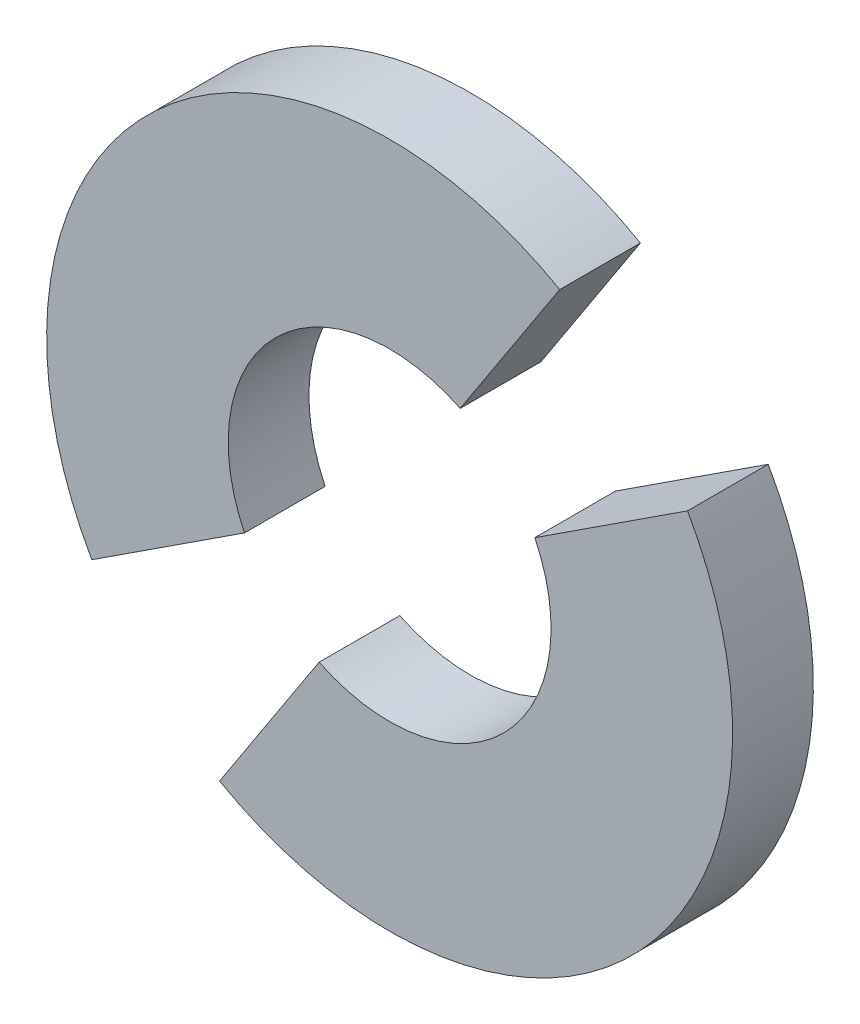
ISO-10303-21;
HEADER;
FILE_DESCRIPTION(('STEP AP214'),'2;1');
FILE_NAME('part.step','',(''),(''),'','','');
FILE_SCHEMA(('AUTOMOTIVE_DESIGN { 1 0 10303 214 1 1 1 1 }'));
ENDSEC;
DATA;
#1=APPLICATION_CONTEXT('core data for automotive mechanical design processes');
#2=APPLICATION_PROTOCOL_DEFINITION('international standard','automotive_design',2000,#1);
#3=PRODUCT_CONTEXT('',#1,'mechanical');
#4=PRODUCT('Part','Part','',(#3));
#5=PRODUCT_RELATED_PRODUCT_CATEGORY('part','',(#4));
#6=PRODUCT_DEFINITION_FORMATION('','',#4);
#7=PRODUCT_DEFINITION_CONTEXT('part definition',#1,'design');
#8=PRODUCT_DEFINITION('design','',#6,#7);
#9=PRODUCT_DEFINITION_SHAPE('','',#8);
#10=(LENGTH_UNIT() NAMED_UNIT(*) SI_UNIT(.MILLI.,.METRE.));
#11=(NAMED_UNIT(*) PLANE_ANGLE_UNIT() SI_UNIT($,.RADIAN.));
#12=(NAMED_UNIT(*) SI_UNIT($,.STERADIAN.) SOLID_ANGLE_UNIT());
#13=UNCERTAINTY_MEASURE_WITH_UNIT(LENGTH_MEASURE(1.E-05),#10,'distance_accuracy_value','');
#14=(GEOMETRIC_REPRESENTATION_CONTEXT(3) GLOBAL_UNCERTAINTY_ASSIGNED_CONTEXT((#13)) GLOBAL_UNIT_ASSIGNED_CONTEXT((#10,
#11,#12)) REPRESENTATION_CONTEXT('',''));
#15=CARTESIAN_POINT('',(0.,0.,0.));
#16=DIRECTION('',(0.,0.,1.));
#17=DIRECTION('',(1.,0.,0.));
#18=AXIS2_PLACEMENT_3D('',#15,#16,#17);
#19=CARTESIAN_POINT('',(-5.00539641632136,-8.95876148749942,6.35));
#20=DIRECTION('',(0.,0.,-1.));
#21=DIRECTION('',(-1.,0.,0.));
#22=AXIS2_PLACEMENT_3D('',#19,#20,#21);
#23=CYLINDRICAL_SURFACE('',#22,26.9875);
#24=CARTESIAN_POINT('',(-5.00539641632136,-8.95876148749942,0.));
#25=DIRECTION('',(0.,0.,1.));
#26=DIRECTION('',(1.,0.,0.));
#27=AXIS2_PLACEMENT_3D('',#24,#25,#26);
#28=CIRCLE('',#27,26.9875);
#29=CARTESIAN_POINT('',(8.37713155542707,14.4769612736055,0.));
#30=VERTEX_POINT('',#29);
#31=CARTESIAN_POINT('',(-28.4411191774267,-22.341289459247,0.));
#32=VERTEX_POINT('',#31);
#33=EDGE_CURVE('E107',#30,#32,#28,.T.);
#34=ORIENTED_EDGE('',*,*,#33,.T.);
#35=DIRECTION('',(0.,0.,-1.));
#36=VECTOR('',#35,1.);
#37=CARTESIAN_POINT('',(-28.4411191774267,-22.341289459247,6.35));
#38=LINE('',#37,#36);
#39=CARTESIAN_POINT('',(-28.4411191774267,-22.341289459247,6.35));
#40=VERTEX_POINT('',#39);
#41=EDGE_CURVE('E12',#40,#32,#38,.T.);
#42=ORIENTED_EDGE('',*,*,#41,.F.);
#43=CARTESIAN_POINT('',(-5.00539641632136,-8.95876148749942,6.35));
#44=DIRECTION('',(0.,0.,1.));
#45=DIRECTION('',(1.,0.,0.));
#46=AXIS2_PLACEMENT_3D('',#43,#44,#45);
#47=CIRCLE('',#46,26.9875);
#48=CARTESIAN_POINT('',(8.37713155542707,14.4769612736055,6.35));
#49=VERTEX_POINT('',#48);
#50=EDGE_CURVE('E95',#49,#40,#47,.T.);
#51=ORIENTED_EDGE('',*,*,#50,.F.);
#52=DIRECTION('',(0.,0.,-1.));
#53=VECTOR('',#52,1.);
#54=CARTESIAN_POINT('',(8.37713155542707,14.4769612736055,6.35));
#55=LINE('',#54,#53);
#56=EDGE_CURVE('E103',#49,#30,#55,.T.);
#57=ORIENTED_EDGE('',*,*,#56,.T.);
#58=EDGE_LOOP('',(#34,#42,#51,#57));
#59=FACE_BOUND('',#58,.T.);
#60=ADVANCED_FACE('F44',(#59),#23,.T.);
#61=CARTESIAN_POINT('',(-28.4411191774267,-22.341289459247,6.35));
#62=DIRECTION('',(-0.546101961014411,0.837718716620451,0.));
#63=DIRECTION('',(-0.837718716620451,-0.546101961014411,0.));
#64=AXIS2_PLACEMENT_3D('',#61,#62,#63);
#65=PLANE('',#64);
#66=DIRECTION('',(0.837718716620451,0.546101961014411,0.));
#67=VECTOR('',#66,1.);
#68=CARTESIAN_POINT('',(-28.4411191774267,-22.341289459247,0.));
#69=LINE('',#68,#67);
#70=CARTESIAN_POINT('',(-16.4279163376508,-14.509981051418,0.));
#71=VERTEX_POINT('',#70);
#72=EDGE_CURVE('E99',#32,#71,#69,.T.);
#73=ORIENTED_EDGE('',*,*,#72,.T.);
#74=DIRECTION('',(0.,0.,-1.));
#75=VECTOR('',#74,1.);
#76=CARTESIAN_POINT('',(-16.4279163376508,-14.509981051418,6.35));
#77=LINE('',#76,#75);
#78=CARTESIAN_POINT('',(-16.4279163376508,-14.509981051418,6.35));
#79=VERTEX_POINT('',#78);
#80=EDGE_CURVE('E52',#79,#71,#77,.T.);
#81=ORIENTED_EDGE('',*,*,#80,.F.);
#82=DIRECTION('',(0.837718716620451,0.546101961014411,0.));
#83=VECTOR('',#82,1.);
#84=CARTESIAN_POINT('',(-28.4411191774267,-22.341289459247,6.35));
#85=LINE('',#84,#83);
#86=EDGE_CURVE('E90',#40,#79,#85,.T.);
#87=ORIENTED_EDGE('',*,*,#86,.F.);
#88=ORIENTED_EDGE('',*,*,#41,.T.);
#89=EDGE_LOOP('',(#73,#81,#87,#88));
#90=FACE_BOUND('',#89,.T.);
#91=ADVANCED_FACE('F98',(#90),#65,.F.);
#92=CARTESIAN_POINT('',(-5.00539641632136,-8.95876148749942,6.35));
#93=DIRECTION('',(0.,0.,-1.));
#94=DIRECTION('',(-1.,0.,0.));
#95=AXIS2_PLACEMENT_3D('',#92,#93,#94);
#96=CYLINDRICAL_SURFACE('',#95,12.7);
#97=CARTESIAN_POINT('',(-5.00539641632136,-8.95876148749942,0.));
#98=DIRECTION('',(0.,0.,-1.));
#99=DIRECTION('',(1.,0.,0.));
#100=AXIS2_PLACEMENT_3D('',#97,#98,#99);
#101=CIRCLE('',#100,12.7);
#102=CARTESIAN_POINT('',(0.545823147597567,2.46375843382983,0.));
#103=VERTEX_POINT('',#102);
#104=EDGE_CURVE('E77',#71,#103,#101,.T.);
#105=ORIENTED_EDGE('',*,*,#104,.T.);
#106=DIRECTION('',(0.,0.,-1.));
#107=VECTOR('',#106,1.);
#108=CARTESIAN_POINT('',(0.545823147597567,2.46375843382983,6.35));
#109=LINE('',#108,#107);
#110=CARTESIAN_POINT('',(0.545823147597567,2.46375843382983,6.35));
#111=VERTEX_POINT('',#110);
#112=EDGE_CURVE('E100',#111,#103,#109,.T.);
#113=ORIENTED_EDGE('',*,*,#112,.F.);
#114=CARTESIAN_POINT('',(-5.00539641632136,-8.95876148749942,6.35));
#115=DIRECTION('',(0.,0.,-1.));
#116=DIRECTION('',(1.,0.,0.));
#117=AXIS2_PLACEMENT_3D('',#114,#115,#116);
#118=CIRCLE('',#117,12.7);
#119=EDGE_CURVE('E93',#79,#111,#118,.T.);
#120=ORIENTED_EDGE('',*,*,#119,.F.);
#121=ORIENTED_EDGE('',*,*,#80,.T.);
#122=EDGE_LOOP('',(#105,#113,#120,#121));
#123=FACE_BOUND('',#122,.T.);
#124=ADVANCED_FACE('F101',(#123),#96,.F.);
#125=CARTESIAN_POINT('',(0.545823147597567,2.46375843382983,6.35));
#126=DIRECTION('',(-0.837718716620432,0.54610196101444,0.));
#127=DIRECTION('',(-0.54610196101444,-0.837718716620432,0.));
#128=AXIS2_PLACEMENT_3D('',#125,#126,#127);
#129=PLANE('',#128);
#130=DIRECTION('',(0.54610196101444,0.837718716620432,0.));
#131=VECTOR('',#130,1.);
#132=CARTESIAN_POINT('',(0.545823147597567,2.46375843382983,0.));
#133=LINE('',#132,#131);
#134=EDGE_CURVE('E83',#103,#30,#133,.T.);
#135=ORIENTED_EDGE('',*,*,#134,.T.);
#136=ORIENTED_EDGE('',*,*,#56,.F.);
#137=DIRECTION('',(0.54610196101444,0.837718716620432,0.));
#138=VECTOR('',#137,1.);
#139=CARTESIAN_POINT('',(0.545823147597567,2.46375843382983,6.35));
#140=LINE('',#139,#138);
#141=EDGE_CURVE('E60',#111,#49,#140,.T.);
#142=ORIENTED_EDGE('',*,*,#141,.F.);
#143=ORIENTED_EDGE('',*,*,#112,.T.);
#144=EDGE_LOOP('',(#135,#136,#142,#143));
#145=FACE_BOUND('',#144,.T.);
#146=ADVANCED_FACE('F114',(#145),#129,.F.);
#147=CARTESIAN_POINT('',(-5.00539641632136,-8.95876148749942,6.35));
#148=DIRECTION('',(0.,0.,1.));
#149=DIRECTION('',(1.,0.,0.));
#150=AXIS2_PLACEMENT_3D('',#147,#148,#149);
#151=PLANE('',#150);
#152=ORIENTED_EDGE('',*,*,#50,.T.);
#153=ORIENTED_EDGE('',*,*,#86,.T.);
#154=ORIENTED_EDGE('',*,*,#119,.T.);
#155=ORIENTED_EDGE('',*,*,#141,.T.);
#156=EDGE_LOOP('',(#152,#153,#154,#155));
#157=FACE_BOUND('',#156,.T.);
#158=ADVANCED_FACE('F91',(#157),#151,.T.);
#159=CARTESIAN_POINT('',(-5.00539641632136,-8.95876148749942,0.));
#160=DIRECTION('',(0.,0.,1.));
#161=DIRECTION('',(1.,0.,0.));
#162=AXIS2_PLACEMENT_3D('',#159,#160,#161);
#163=PLANE('',#162);
#164=ORIENTED_EDGE('',*,*,#33,.F.);
#165=ORIENTED_EDGE('',*,*,#134,.F.);
#166=ORIENTED_EDGE('',*,*,#104,.F.);
#167=ORIENTED_EDGE('',*,*,#72,.F.);
#168=EDGE_LOOP('',(#164,#165,#166,#167));
#169=FACE_BOUND('',#168,.T.);
#170=ADVANCED_FACE('F117',(#169),#163,.F.);
#171=CLOSED_SHELL('',(#60,#91,#124,#146,#158,#170));
#172=MANIFOLD_SOLID_BREP('B2',#171);
#173=CARTESIAN_POINT('',(-5.00539641632136,-8.95876148749942,6.35));
#174=DIRECTION('',(0.,0.,-1.));
#175=DIRECTION('',(-1.,0.,0.));
#176=AXIS2_PLACEMENT_3D('',#173,#174,#175);
#177=CYLINDRICAL_SURFACE('',#176,12.7);
#178=CARTESIAN_POINT('',(-5.00539641632136,-8.95876148749942,0.));
#179=DIRECTION('',(0.,0.,-1.));
#180=DIRECTION('',(1.,0.,0.));
#181=AXIS2_PLACEMENT_3D('',#178,#179,#180);
#182=CIRCLE('',#181,12.7);
#183=CARTESIAN_POINT('',(6.41712350500799,-3.4075419235807,0.));
#184=VERTEX_POINT('',#183);
#185=CARTESIAN_POINT('',(-10.5566159802403,-20.3812814088287,0.));
#186=VERTEX_POINT('',#185);
#187=EDGE_CURVE('E230',#184,#186,#182,.T.);
#188=ORIENTED_EDGE('',*,*,#187,.T.);
#189=DIRECTION('',(0.,0.,-1.));
#190=VECTOR('',#189,1.);
#191=CARTESIAN_POINT('',(-10.5566159802403,-20.3812814088287,6.35));
#192=LINE('',#191,#190);
#193=CARTESIAN_POINT('',(-10.5566159802403,-20.3812814088287,6.35));
#194=VERTEX_POINT('',#193);
#195=EDGE_CURVE('E42',#194,#186,#192,.T.);
#196=ORIENTED_EDGE('',*,*,#195,.F.);
#197=CARTESIAN_POINT('',(-5.00539641632136,-8.95876148749942,6.35));
#198=DIRECTION('',(0.,0.,-1.));
#199=DIRECTION('',(1.,0.,0.));
#200=AXIS2_PLACEMENT_3D('',#197,#198,#199);
#201=CIRCLE('',#200,12.7);
#202=CARTESIAN_POINT('',(6.41712350500799,-3.4075419235807,6.35));
#203=VERTEX_POINT('',#202);
#204=EDGE_CURVE('E218',#203,#194,#201,.T.);
#205=ORIENTED_EDGE('',*,*,#204,.F.);
#206=DIRECTION('',(0.,0.,-1.));
#207=VECTOR('',#206,1.);
#208=CARTESIAN_POINT('',(6.41712350500799,-3.4075419235807,6.35));
#209=LINE('',#208,#207);
#210=EDGE_CURVE('E226',#203,#184,#209,.T.);
#211=ORIENTED_EDGE('',*,*,#210,.T.);
#212=EDGE_LOOP('',(#188,#196,#205,#211));
#213=FACE_BOUND('',#212,.T.);
#214=ADVANCED_FACE('F167',(#213),#177,.F.);
#215=CARTESIAN_POINT('',(-10.5566159802403,-20.3812814088287,6.35));
#216=DIRECTION('',(0.837718716620431,-0.546101961014441,0.));
#217=DIRECTION('',(0.546101961014441,0.837718716620431,0.));
#218=AXIS2_PLACEMENT_3D('',#215,#216,#217);
#219=PLANE('',#218);
#220=DIRECTION('',(-0.546101961014441,-0.837718716620431,0.));
#221=VECTOR('',#220,1.);
#222=CARTESIAN_POINT('',(-10.5566159802403,-20.3812814088287,0.));
#223=LINE('',#222,#221);
#224=CARTESIAN_POINT('',(-18.3879243880698,-32.3944842486043,0.));
#225=VERTEX_POINT('',#224);
#226=EDGE_CURVE('E222',#186,#225,#223,.T.);
#227=ORIENTED_EDGE('',*,*,#226,.T.);
#228=DIRECTION('',(0.,0.,-1.));
#229=VECTOR('',#228,1.);
#230=CARTESIAN_POINT('',(-18.3879243880698,-32.3944842486043,6.35));
#231=LINE('',#230,#229);
#232=CARTESIAN_POINT('',(-18.3879243880698,-32.3944842486043,6.35));
#233=VERTEX_POINT('',#232);
#234=EDGE_CURVE('E175',#233,#225,#231,.T.);
#235=ORIENTED_EDGE('',*,*,#234,.F.);
#236=DIRECTION('',(-0.546101961014441,-0.837718716620431,0.));
#237=VECTOR('',#236,1.);
#238=CARTESIAN_POINT('',(-10.5566159802403,-20.3812814088287,6.35));
#239=LINE('',#238,#237);
#240=EDGE_CURVE('E213',#194,#233,#239,.T.);
#241=ORIENTED_EDGE('',*,*,#240,.F.);
#242=ORIENTED_EDGE('',*,*,#195,.T.);
#243=EDGE_LOOP('',(#227,#235,#241,#242));
#244=FACE_BOUND('',#243,.T.);
#245=ADVANCED_FACE('F221',(#244),#219,.F.);
#246=CARTESIAN_POINT('',(-5.00539641632136,-8.95876148749942,6.35));
#247=DIRECTION('',(0.,0.,-1.));
#248=DIRECTION('',(-1.,0.,0.));
#249=AXIS2_PLACEMENT_3D('',#246,#247,#248);
#250=CYLINDRICAL_SURFACE('',#249,26.9875);
#251=CARTESIAN_POINT('',(-5.00539641632136,-8.95876148749942,0.));
#252=DIRECTION('',(0.,0.,1.));
#253=DIRECTION('',(1.,0.,0.));
#254=AXIS2_PLACEMENT_3D('',#251,#252,#253);
#255=CIRCLE('',#254,26.9875);
#256=CARTESIAN_POINT('',(18.4303263447838,4.42376648424853,0.));
#257=VERTEX_POINT('',#256);
#258=EDGE_CURVE('E200',#225,#257,#255,.T.);
#259=ORIENTED_EDGE('',*,*,#258,.T.);
#260=DIRECTION('',(0.,0.,-1.));
#261=VECTOR('',#260,1.);
#262=CARTESIAN_POINT('',(18.4303263447838,4.42376648424853,6.35));
#263=LINE('',#262,#261);
#264=CARTESIAN_POINT('',(18.4303263447838,4.42376648424853,6.35));
#265=VERTEX_POINT('',#264);
#266=EDGE_CURVE('E223',#265,#257,#263,.T.);
#267=ORIENTED_EDGE('',*,*,#266,.F.);
#268=CARTESIAN_POINT('',(-5.00539641632136,-8.95876148749942,6.35));
#269=DIRECTION('',(0.,0.,1.));
#270=DIRECTION('',(1.,0.,0.));
#271=AXIS2_PLACEMENT_3D('',#268,#269,#270);
#272=CIRCLE('',#271,26.9875);
#273=EDGE_CURVE('E216',#233,#265,#272,.T.);
#274=ORIENTED_EDGE('',*,*,#273,.F.);
#275=ORIENTED_EDGE('',*,*,#234,.T.);
#276=EDGE_LOOP('',(#259,#267,#274,#275));
#277=FACE_BOUND('',#276,.T.);
#278=ADVANCED_FACE('F224',(#277),#250,.T.);
#279=CARTESIAN_POINT('',(18.4303263447838,4.42376648424854,6.35));
#280=DIRECTION('',(0.546101961014422,-0.837718716620443,0.));
#281=DIRECTION('',(0.837718716620443,0.546101961014422,0.));
#282=AXIS2_PLACEMENT_3D('',#279,#280,#281);
#283=PLANE('',#282);
#284=DIRECTION('',(-0.837718716620443,-0.546101961014422,0.));
#285=VECTOR('',#284,1.);
#286=CARTESIAN_POINT('',(18.4303263447838,4.42376648424854,0.));
#287=LINE('',#286,#285);
#288=EDGE_CURVE('E206',#257,#184,#287,.T.);
#289=ORIENTED_EDGE('',*,*,#288,.T.);
#290=ORIENTED_EDGE('',*,*,#210,.F.);
#291=DIRECTION('',(-0.837718716620443,-0.546101961014422,0.));
#292=VECTOR('',#291,1.);
#293=CARTESIAN_POINT('',(18.4303263447838,4.42376648424854,6.35));
#294=LINE('',#293,#292);
#295=EDGE_CURVE('E183',#265,#203,#294,.T.);
#296=ORIENTED_EDGE('',*,*,#295,.F.);
#297=ORIENTED_EDGE('',*,*,#266,.T.);
#298=EDGE_LOOP('',(#289,#290,#296,#297));
#299=FACE_BOUND('',#298,.T.);
#300=ADVANCED_FACE('F237',(#299),#283,.F.);
#301=CARTESIAN_POINT('',(-5.00539641632136,-8.95876148749942,6.35));
#302=DIRECTION('',(0.,0.,1.));
#303=DIRECTION('',(1.,0.,0.));
#304=AXIS2_PLACEMENT_3D('',#301,#302,#303);
#305=PLANE('',#304);
#306=ORIENTED_EDGE('',*,*,#204,.T.);
#307=ORIENTED_EDGE('',*,*,#240,.T.);
#308=ORIENTED_EDGE('',*,*,#273,.T.);
#309=ORIENTED_EDGE('',*,*,#295,.T.);
#310=EDGE_LOOP('',(#306,#307,#308,#309));
#311=FACE_BOUND('',#310,.T.);
#312=ADVANCED_FACE('F214',(#311),#305,.T.);
#313=CARTESIAN_POINT('',(-5.00539641632136,-8.95876148749942,0.));
#314=DIRECTION('',(0.,0.,1.));
#315=DIRECTION('',(1.,0.,0.));
#316=AXIS2_PLACEMENT_3D('',#313,#314,#315);
#317=PLANE('',#316);
#318=ORIENTED_EDGE('',*,*,#187,.F.);
#319=ORIENTED_EDGE('',*,*,#288,.F.);
#320=ORIENTED_EDGE('',*,*,#258,.F.);
#321=ORIENTED_EDGE('',*,*,#226,.F.);
#322=EDGE_LOOP('',(#318,#319,#320,#321));
#323=FACE_BOUND('',#322,.T.);
#324=ADVANCED_FACE('F240',(#323),#317,.F.);
#325=CLOSED_SHELL('',(#214,#245,#278,#300,#312,#324));
#326=MANIFOLD_SOLID_BREP('B6',#325);
#327=ADVANCED_BREP_SHAPE_REPRESENTATION('',(#18,#172,#326),#14);
#328=SHAPE_DEFINITION_REPRESENTATION(#9,#327);
ENDSEC;
END-ISO-10303-21;
